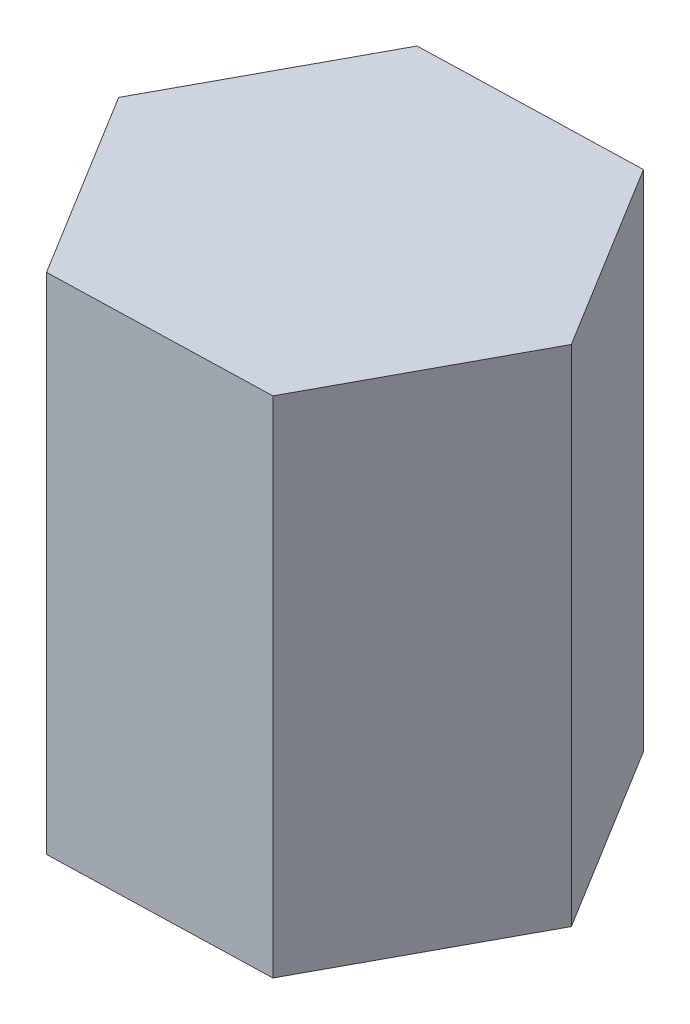
ISO-10303-21;
HEADER;
FILE_DESCRIPTION(('STEP AP214'),'2;1');
FILE_NAME('part.step','',(''),(''),'','','');
FILE_SCHEMA(('AUTOMOTIVE_DESIGN { 1 0 10303 214 1 1 1 1 }'));
ENDSEC;
DATA;
#1=APPLICATION_CONTEXT('core data for automotive mechanical design processes');
#2=APPLICATION_PROTOCOL_DEFINITION('international standard','automotive_design',2000,#1);
#3=PRODUCT_CONTEXT('',#1,'mechanical');
#4=PRODUCT('Part','Part','',(#3));
#5=PRODUCT_RELATED_PRODUCT_CATEGORY('part','',(#4));
#6=PRODUCT_DEFINITION_FORMATION('','',#4);
#7=PRODUCT_DEFINITION_CONTEXT('part definition',#1,'design');
#8=PRODUCT_DEFINITION('design','',#6,#7);
#9=PRODUCT_DEFINITION_SHAPE('','',#8);
#10=(LENGTH_UNIT() NAMED_UNIT(*) SI_UNIT(.MILLI.,.METRE.));
#11=(NAMED_UNIT(*) PLANE_ANGLE_UNIT() SI_UNIT($,.RADIAN.));
#12=(NAMED_UNIT(*) SI_UNIT($,.STERADIAN.) SOLID_ANGLE_UNIT());
#13=UNCERTAINTY_MEASURE_WITH_UNIT(LENGTH_MEASURE(1.E-05),#10,'distance_accuracy_value','');
#14=(GEOMETRIC_REPRESENTATION_CONTEXT(3) GLOBAL_UNCERTAINTY_ASSIGNED_CONTEXT((#13)) GLOBAL_UNIT_ASSIGNED_CONTEXT((#10,
#11,#12)) REPRESENTATION_CONTEXT('',''));
#15=CARTESIAN_POINT('',(0.,0.,0.));
#16=DIRECTION('',(0.,0.,1.));
#17=DIRECTION('',(1.,0.,0.));
#18=AXIS2_PLACEMENT_3D('',#15,#16,#17);
#19=CARTESIAN_POINT('',(43.669330751291,100.,-1.23153468679552));
#20=DIRECTION('',(-0.851586148712255,0.,0.524214680566491));
#21=DIRECTION('',(0.524214680566491,0.,0.851586148712255));
#22=AXIS2_PLACEMENT_3D('',#19,#20,#21);
#23=PLANE('',#22);
#24=DIRECTION('',(-0.524214680566491,0.,-0.851586148712255));
#25=VECTOR('',#24,1.);
#26=CARTESIAN_POINT('',(43.669330751291,0.,-1.23153468679552));
#27=LINE('',#26,#25);
#28=CARTESIAN_POINT('',(43.669330751291,0.,-1.23153468679552));
#29=VERTEX_POINT('',#28);
#30=CARTESIAN_POINT('',(20.7681250512389,0.,-38.4345171402808));
#31=VERTEX_POINT('',#30);
#32=EDGE_CURVE('E116',#29,#31,#27,.T.);
#33=ORIENTED_EDGE('',*,*,#32,.T.);
#34=DIRECTION('',(0.,-1.,0.));
#35=VECTOR('',#34,1.);
#36=CARTESIAN_POINT('',(20.7681250512389,100.,-38.4345171402808));
#37=LINE('',#36,#35);
#38=CARTESIAN_POINT('',(20.7681250512389,100.,-38.4345171402808));
#39=VERTEX_POINT('',#38);
#40=EDGE_CURVE('E11',#39,#31,#37,.T.);
#41=ORIENTED_EDGE('',*,*,#40,.F.);
#42=DIRECTION('',(-0.524214680566491,0.,-0.851586148712255));
#43=VECTOR('',#42,1.);
#44=CARTESIAN_POINT('',(43.669330751291,100.,-1.23153468679552));
#45=LINE('',#44,#43);
#46=CARTESIAN_POINT('',(43.669330751291,100.,-1.23153468679552));
#47=VERTEX_POINT('',#46);
#48=EDGE_CURVE('E126',#47,#39,#45,.T.);
#49=ORIENTED_EDGE('',*,*,#48,.F.);
#50=DIRECTION('',(0.,-1.,0.));
#51=VECTOR('',#50,1.);
#52=CARTESIAN_POINT('',(43.669330751291,100.,-1.23153468679552));
#53=LINE('',#52,#51);
#54=EDGE_CURVE('E112',#47,#29,#53,.T.);
#55=ORIENTED_EDGE('',*,*,#54,.T.);
#56=EDGE_LOOP('',(#33,#41,#49,#55));
#57=FACE_BOUND('',#56,.T.);
#58=ADVANCED_FACE('F32',(#57),#23,.F.);
#59=CARTESIAN_POINT('',(20.7681250512389,100.,-38.4345171402808));
#60=DIRECTION('',(0.0281901560511988,0.,0.999602578579011));
#61=DIRECTION('',(0.999602578579012,0.,-0.0281901560511988));
#62=AXIS2_PLACEMENT_3D('',#59,#60,#61);
#63=PLANE('',#62);
#64=DIRECTION('',(-0.999602578579011,0.,0.0281901560511988));
#65=VECTOR('',#64,1.);
#66=CARTESIAN_POINT('',(20.7681250512389,0.,-38.4345171402808));
#67=LINE('',#66,#65);
#68=CARTESIAN_POINT('',(-22.9012057000521,0.,-37.2029824534852));
#69=VERTEX_POINT('',#68);
#70=EDGE_CURVE('E119',#31,#69,#67,.T.);
#71=ORIENTED_EDGE('',*,*,#70,.T.);
#72=DIRECTION('',(0.,-1.,0.));
#73=VECTOR('',#72,1.);
#74=CARTESIAN_POINT('',(-22.9012057000521,100.,-37.2029824534852));
#75=LINE('',#74,#73);
#76=CARTESIAN_POINT('',(-22.9012057000521,100.,-37.2029824534852));
#77=VERTEX_POINT('',#76);
#78=EDGE_CURVE('E40',#77,#69,#75,.T.);
#79=ORIENTED_EDGE('',*,*,#78,.F.);
#80=DIRECTION('',(-0.999602578579011,0.,0.0281901560511988));
#81=VECTOR('',#80,1.);
#82=CARTESIAN_POINT('',(20.7681250512389,100.,-38.4345171402808));
#83=LINE('',#82,#81);
#84=EDGE_CURVE('E85',#39,#77,#83,.T.);
#85=ORIENTED_EDGE('',*,*,#84,.F.);
#86=ORIENTED_EDGE('',*,*,#40,.T.);
#87=EDGE_LOOP('',(#71,#79,#85,#86));
#88=FACE_BOUND('',#87,.T.);
#89=ADVANCED_FACE('F150',(#88),#63,.F.);
#90=CARTESIAN_POINT('',(-22.9012057000521,100.,-37.2029824534852));
#91=DIRECTION('',(0.879776304763454,0.,0.47538789801252));
#92=DIRECTION('',(0.47538789801252,0.,-0.879776304763454));
#93=AXIS2_PLACEMENT_3D('',#90,#91,#92);
#94=PLANE('',#93);
#95=DIRECTION('',(-0.47538789801252,0.,0.879776304763454));
#96=VECTOR('',#95,1.);
#97=CARTESIAN_POINT('',(-22.9012057000521,0.,-37.2029824534852));
#98=LINE('',#97,#96);
#99=CARTESIAN_POINT('',(-43.669330751291,0.,1.23153468679553));
#100=VERTEX_POINT('',#99);
#101=EDGE_CURVE('E121',#69,#100,#98,.T.);
#102=ORIENTED_EDGE('',*,*,#101,.T.);
#103=DIRECTION('',(0.,-1.,0.));
#104=VECTOR('',#103,1.);
#105=CARTESIAN_POINT('',(-43.669330751291,100.,1.23153468679553));
#106=LINE('',#105,#104);
#107=CARTESIAN_POINT('',(-43.669330751291,100.,1.23153468679553));
#108=VERTEX_POINT('',#107);
#109=EDGE_CURVE('E107',#108,#100,#106,.T.);
#110=ORIENTED_EDGE('',*,*,#109,.F.);
#111=DIRECTION('',(-0.47538789801252,0.,0.879776304763454));
#112=VECTOR('',#111,1.);
#113=CARTESIAN_POINT('',(-22.9012057000521,100.,-37.2029824534852));
#114=LINE('',#113,#112);
#115=EDGE_CURVE('E98',#77,#108,#114,.T.);
#116=ORIENTED_EDGE('',*,*,#115,.F.);
#117=ORIENTED_EDGE('',*,*,#78,.T.);
#118=EDGE_LOOP('',(#102,#110,#116,#117));
#119=FACE_BOUND('',#118,.T.);
#120=ADVANCED_FACE('F132',(#119),#94,.F.);
#121=CARTESIAN_POINT('',(-43.669330751291,100.,1.23153468679553));
#122=DIRECTION('',(0.851586148712255,0.,-0.524214680566492));
#123=DIRECTION('',(-0.524214680566492,0.,-0.851586148712255));
#124=AXIS2_PLACEMENT_3D('',#121,#122,#123);
#125=PLANE('',#124);
#126=DIRECTION('',(0.524214680566492,0.,0.851586148712255));
#127=VECTOR('',#126,1.);
#128=CARTESIAN_POINT('',(-43.669330751291,0.,1.23153468679553));
#129=LINE('',#128,#127);
#130=CARTESIAN_POINT('',(-20.7681250512388,0.,38.4345171402808));
#131=VERTEX_POINT('',#130);
#132=EDGE_CURVE('E106',#100,#131,#129,.T.);
#133=ORIENTED_EDGE('',*,*,#132,.T.);
#134=DIRECTION('',(0.,-1.,0.));
#135=VECTOR('',#134,1.);
#136=CARTESIAN_POINT('',(-20.7681250512388,100.,38.4345171402808));
#137=LINE('',#136,#135);
#138=CARTESIAN_POINT('',(-20.7681250512388,100.,38.4345171402808));
#139=VERTEX_POINT('',#138);
#140=EDGE_CURVE('E103',#139,#131,#137,.T.);
#141=ORIENTED_EDGE('',*,*,#140,.F.);
#142=DIRECTION('',(0.524214680566492,0.,0.851586148712255));
#143=VECTOR('',#142,1.);
#144=CARTESIAN_POINT('',(-43.669330751291,100.,1.23153468679553));
#145=LINE('',#144,#143);
#146=EDGE_CURVE('E92',#108,#139,#145,.T.);
#147=ORIENTED_EDGE('',*,*,#146,.F.);
#148=ORIENTED_EDGE('',*,*,#109,.T.);
#149=EDGE_LOOP('',(#133,#141,#147,#148));
#150=FACE_BOUND('',#149,.T.);
#151=ADVANCED_FACE('F104',(#150),#125,.F.);
#152=CARTESIAN_POINT('',(-20.7681250512388,100.,38.4345171402808));
#153=DIRECTION('',(-0.0281901560511986,0.,-0.999602578579012));
#154=DIRECTION('',(-0.999602578579012,0.,0.0281901560511986));
#155=AXIS2_PLACEMENT_3D('',#152,#153,#154);
#156=PLANE('',#155);
#157=DIRECTION('',(0.999602578579012,0.,-0.0281901560511986));
#158=VECTOR('',#157,1.);
#159=CARTESIAN_POINT('',(-20.7681250512388,0.,38.4345171402808));
#160=LINE('',#159,#158);
#161=CARTESIAN_POINT('',(22.9012057000521,0.,37.2029824534853));
#162=VERTEX_POINT('',#161);
#163=EDGE_CURVE('E71',#131,#162,#160,.T.);
#164=ORIENTED_EDGE('',*,*,#163,.T.);
#165=DIRECTION('',(0.,-1.,0.));
#166=VECTOR('',#165,1.);
#167=CARTESIAN_POINT('',(22.9012057000521,100.,37.2029824534853));
#168=LINE('',#167,#166);
#169=CARTESIAN_POINT('',(22.9012057000521,100.,37.2029824534853));
#170=VERTEX_POINT('',#169);
#171=EDGE_CURVE('E108',#170,#162,#168,.T.);
#172=ORIENTED_EDGE('',*,*,#171,.F.);
#173=DIRECTION('',(0.999602578579012,0.,-0.0281901560511986));
#174=VECTOR('',#173,1.);
#175=CARTESIAN_POINT('',(-20.7681250512388,100.,38.4345171402808));
#176=LINE('',#175,#174);
#177=EDGE_CURVE('E96',#139,#170,#176,.T.);
#178=ORIENTED_EDGE('',*,*,#177,.F.);
#179=ORIENTED_EDGE('',*,*,#140,.T.);
#180=EDGE_LOOP('',(#164,#172,#178,#179));
#181=FACE_BOUND('',#180,.T.);
#182=ADVANCED_FACE('F110',(#181),#156,.F.);
#183=CARTESIAN_POINT('',(22.9012057000521,100.,37.2029824534853));
#184=DIRECTION('',(-0.879776304763454,0.,-0.47538789801252));
#185=DIRECTION('',(-0.47538789801252,0.,0.879776304763454));
#186=AXIS2_PLACEMENT_3D('',#183,#184,#185);
#187=PLANE('',#186);
#188=DIRECTION('',(0.47538789801252,0.,-0.879776304763454));
#189=VECTOR('',#188,1.);
#190=CARTESIAN_POINT('',(22.9012057000521,0.,37.2029824534853));
#191=LINE('',#190,#189);
#192=EDGE_CURVE('E77',#162,#29,#191,.T.);
#193=ORIENTED_EDGE('',*,*,#192,.T.);
#194=ORIENTED_EDGE('',*,*,#54,.F.);
#195=DIRECTION('',(0.47538789801252,0.,-0.879776304763454));
#196=VECTOR('',#195,1.);
#197=CARTESIAN_POINT('',(22.9012057000521,100.,37.2029824534853));
#198=LINE('',#197,#196);
#199=EDGE_CURVE('E48',#170,#47,#198,.T.);
#200=ORIENTED_EDGE('',*,*,#199,.F.);
#201=ORIENTED_EDGE('',*,*,#171,.T.);
#202=EDGE_LOOP('',(#193,#194,#200,#201));
#203=FACE_BOUND('',#202,.T.);
#204=ADVANCED_FACE('F139',(#203),#187,.F.);
#205=CARTESIAN_POINT('',(0.,100.,0.));
#206=DIRECTION('',(0.,1.,0.));
#207=DIRECTION('',(0.,0.,1.));
#208=AXIS2_PLACEMENT_3D('',#205,#206,#207);
#209=PLANE('',#208);
#210=ORIENTED_EDGE('',*,*,#48,.T.);
#211=ORIENTED_EDGE('',*,*,#84,.T.);
#212=ORIENTED_EDGE('',*,*,#115,.T.);
#213=ORIENTED_EDGE('',*,*,#146,.T.);
#214=ORIENTED_EDGE('',*,*,#177,.T.);
#215=ORIENTED_EDGE('',*,*,#199,.T.);
#216=EDGE_LOOP('',(#210,#211,#212,#213,#214,#215));
#217=FACE_BOUND('',#216,.T.);
#218=ADVANCED_FACE('F94',(#217),#209,.T.);
#219=CARTESIAN_POINT('',(0.,0.,0.));
#220=DIRECTION('',(0.,1.,0.));
#221=DIRECTION('',(0.,0.,1.));
#222=AXIS2_PLACEMENT_3D('',#219,#220,#221);
#223=PLANE('',#222);
#224=ORIENTED_EDGE('',*,*,#32,.F.);
#225=ORIENTED_EDGE('',*,*,#192,.F.);
#226=ORIENTED_EDGE('',*,*,#163,.F.);
#227=ORIENTED_EDGE('',*,*,#132,.F.);
#228=ORIENTED_EDGE('',*,*,#101,.F.);
#229=ORIENTED_EDGE('',*,*,#70,.F.);
#230=EDGE_LOOP('',(#224,#225,#226,#227,#228,#229));
#231=FACE_BOUND('',#230,.T.);
#232=ADVANCED_FACE('F135',(#231),#223,.F.);
#233=CLOSED_SHELL('',(#58,#89,#120,#151,#182,#204,#218,#232));
#234=MANIFOLD_SOLID_BREP('B2',#233);
#235=ADVANCED_BREP_SHAPE_REPRESENTATION('',(#18,#234),#14);
#236=SHAPE_DEFINITION_REPRESENTATION(#9,#235);
ENDSEC;
END-ISO-10303-21;
